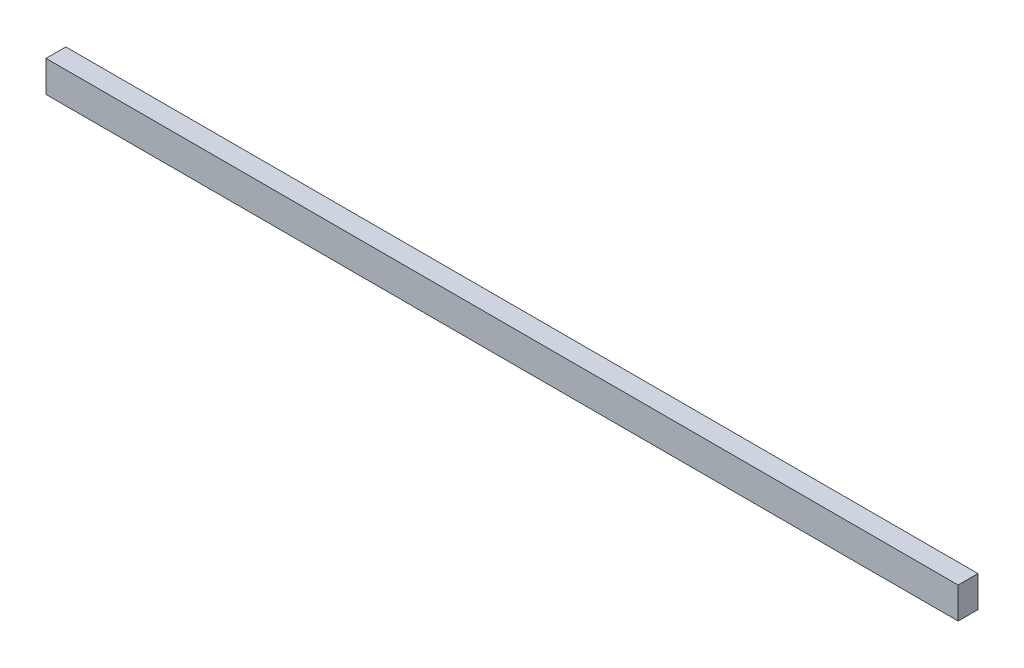
ISO-10303-21;
HEADER;
FILE_DESCRIPTION(('STEP AP214'),'2;1');
FILE_NAME('part.step','',(''),(''),'','','');
FILE_SCHEMA(('AUTOMOTIVE_DESIGN { 1 0 10303 214 1 1 1 1 }'));
ENDSEC;
DATA;
#1=APPLICATION_CONTEXT('core data for automotive mechanical design processes');
#2=APPLICATION_PROTOCOL_DEFINITION('international standard','automotive_design',2000,#1);
#3=PRODUCT_CONTEXT('',#1,'mechanical');
#4=PRODUCT('Part','Part','',(#3));
#5=PRODUCT_RELATED_PRODUCT_CATEGORY('part','',(#4));
#6=PRODUCT_DEFINITION_FORMATION('','',#4);
#7=PRODUCT_DEFINITION_CONTEXT('part definition',#1,'design');
#8=PRODUCT_DEFINITION('design','',#6,#7);
#9=PRODUCT_DEFINITION_SHAPE('','',#8);
#10=(LENGTH_UNIT() NAMED_UNIT(*) SI_UNIT(.MILLI.,.METRE.));
#11=(NAMED_UNIT(*) PLANE_ANGLE_UNIT() SI_UNIT($,.RADIAN.));
#12=(NAMED_UNIT(*) SI_UNIT($,.STERADIAN.) SOLID_ANGLE_UNIT());
#13=UNCERTAINTY_MEASURE_WITH_UNIT(LENGTH_MEASURE(1.E-05),#10,'distance_accuracy_value','');
#14=(GEOMETRIC_REPRESENTATION_CONTEXT(3) GLOBAL_UNCERTAINTY_ASSIGNED_CONTEXT((#13)) GLOBAL_UNIT_ASSIGNED_CONTEXT((#10,
#11,#12)) REPRESENTATION_CONTEXT('',''));
#15=CARTESIAN_POINT('',(0.,0.,0.));
#16=DIRECTION('',(0.,0.,1.));
#17=DIRECTION('',(1.,0.,0.));
#18=AXIS2_PLACEMENT_3D('',#15,#16,#17);
#19=CARTESIAN_POINT('',(146.05,-5.,6.35));
#20=DIRECTION('',(-1.,0.,0.));
#21=DIRECTION('',(0.,0.,1.));
#22=AXIS2_PLACEMENT_3D('',#19,#20,#21);
#23=PLANE('',#22);
#24=DIRECTION('',(0.,1.,0.));
#25=VECTOR('',#24,1.);
#26=CARTESIAN_POINT('',(146.05,-5.,0.));
#27=LINE('',#26,#25);
#28=CARTESIAN_POINT('',(146.05,-5.,0.));
#29=VERTEX_POINT('',#28);
#30=CARTESIAN_POINT('',(146.05,5.,0.));
#31=VERTEX_POINT('',#30);
#32=EDGE_CURVE('E99',#29,#31,#27,.T.);
#33=ORIENTED_EDGE('',*,*,#32,.T.);
#34=DIRECTION('',(0.,0.,-1.));
#35=VECTOR('',#34,1.);
#36=CARTESIAN_POINT('',(146.05,5.,6.35));
#37=LINE('',#36,#35);
#38=CARTESIAN_POINT('',(146.05,5.,6.35));
#39=VERTEX_POINT('',#38);
#40=EDGE_CURVE('E11',#39,#31,#37,.T.);
#41=ORIENTED_EDGE('',*,*,#40,.F.);
#42=DIRECTION('',(0.,1.,0.));
#43=VECTOR('',#42,1.);
#44=CARTESIAN_POINT('',(146.05,-5.,6.35));
#45=LINE('',#44,#43);
#46=CARTESIAN_POINT('',(146.05,-5.,6.35));
#47=VERTEX_POINT('',#46);
#48=EDGE_CURVE('E87',#47,#39,#45,.T.);
#49=ORIENTED_EDGE('',*,*,#48,.F.);
#50=DIRECTION('',(0.,0.,-1.));
#51=VECTOR('',#50,1.);
#52=CARTESIAN_POINT('',(146.05,-5.,6.35));
#53=LINE('',#52,#51);
#54=EDGE_CURVE('E95',#47,#29,#53,.T.);
#55=ORIENTED_EDGE('',*,*,#54,.T.);
#56=EDGE_LOOP('',(#33,#41,#49,#55));
#57=FACE_BOUND('',#56,.T.);
#58=ADVANCED_FACE('F36',(#57),#23,.F.);
#59=CARTESIAN_POINT('',(-146.05,5.,6.35));
#60=DIRECTION('',(0.,-1.,0.));
#61=DIRECTION('',(0.,0.,-1.));
#62=AXIS2_PLACEMENT_3D('',#59,#60,#61);
#63=PLANE('',#62);
#64=DIRECTION('',(-1.,0.,0.));
#65=VECTOR('',#64,1.);
#66=CARTESIAN_POINT('',(-146.05,5.,0.));
#67=LINE('',#66,#65);
#68=CARTESIAN_POINT('',(-146.05,5.,0.));
#69=VERTEX_POINT('',#68);
#70=EDGE_CURVE('E91',#31,#69,#67,.T.);
#71=ORIENTED_EDGE('',*,*,#70,.T.);
#72=DIRECTION('',(0.,0.,-1.));
#73=VECTOR('',#72,1.);
#74=CARTESIAN_POINT('',(-146.05,5.,6.35));
#75=LINE('',#74,#73);
#76=CARTESIAN_POINT('',(-146.05,5.,6.35));
#77=VERTEX_POINT('',#76);
#78=EDGE_CURVE('E44',#77,#69,#75,.T.);
#79=ORIENTED_EDGE('',*,*,#78,.F.);
#80=DIRECTION('',(-1.,0.,0.));
#81=VECTOR('',#80,1.);
#82=CARTESIAN_POINT('',(-146.05,5.,6.35));
#83=LINE('',#82,#81);
#84=EDGE_CURVE('E82',#39,#77,#83,.T.);
#85=ORIENTED_EDGE('',*,*,#84,.F.);
#86=ORIENTED_EDGE('',*,*,#40,.T.);
#87=EDGE_LOOP('',(#71,#79,#85,#86));
#88=FACE_BOUND('',#87,.T.);
#89=ADVANCED_FACE('F90',(#88),#63,.F.);
#90=CARTESIAN_POINT('',(-146.05,-5.,6.35));
#91=DIRECTION('',(1.,0.,0.));
#92=DIRECTION('',(0.,0.,-1.));
#93=AXIS2_PLACEMENT_3D('',#90,#91,#92);
#94=PLANE('',#93);
#95=DIRECTION('',(0.,-1.,0.));
#96=VECTOR('',#95,1.);
#97=CARTESIAN_POINT('',(-146.05,-5.,0.));
#98=LINE('',#97,#96);
#99=CARTESIAN_POINT('',(-146.05,-5.,0.));
#100=VERTEX_POINT('',#99);
#101=EDGE_CURVE('E69',#69,#100,#98,.T.);
#102=ORIENTED_EDGE('',*,*,#101,.T.);
#103=DIRECTION('',(0.,0.,-1.));
#104=VECTOR('',#103,1.);
#105=CARTESIAN_POINT('',(-146.05,-5.,6.35));
#106=LINE('',#105,#104);
#107=CARTESIAN_POINT('',(-146.05,-5.,6.35));
#108=VERTEX_POINT('',#107);
#109=EDGE_CURVE('E92',#108,#100,#106,.T.);
#110=ORIENTED_EDGE('',*,*,#109,.F.);
#111=DIRECTION('',(0.,-1.,0.));
#112=VECTOR('',#111,1.);
#113=CARTESIAN_POINT('',(-146.05,-5.,6.35));
#114=LINE('',#113,#112);
#115=EDGE_CURVE('E85',#77,#108,#114,.T.);
#116=ORIENTED_EDGE('',*,*,#115,.F.);
#117=ORIENTED_EDGE('',*,*,#78,.T.);
#118=EDGE_LOOP('',(#102,#110,#116,#117));
#119=FACE_BOUND('',#118,.T.);
#120=ADVANCED_FACE('F93',(#119),#94,.F.);
#121=CARTESIAN_POINT('',(-146.05,-5.,6.35));
#122=DIRECTION('',(0.,1.,0.));
#123=DIRECTION('',(0.,0.,1.));
#124=AXIS2_PLACEMENT_3D('',#121,#122,#123);
#125=PLANE('',#124);
#126=DIRECTION('',(1.,0.,0.));
#127=VECTOR('',#126,1.);
#128=CARTESIAN_POINT('',(-146.05,-5.,0.));
#129=LINE('',#128,#127);
#130=EDGE_CURVE('E75',#100,#29,#129,.T.);
#131=ORIENTED_EDGE('',*,*,#130,.T.);
#132=ORIENTED_EDGE('',*,*,#54,.F.);
#133=DIRECTION('',(1.,0.,0.));
#134=VECTOR('',#133,1.);
#135=CARTESIAN_POINT('',(-146.05,-5.,6.35));
#136=LINE('',#135,#134);
#137=EDGE_CURVE('E52',#108,#47,#136,.T.);
#138=ORIENTED_EDGE('',*,*,#137,.F.);
#139=ORIENTED_EDGE('',*,*,#109,.T.);
#140=EDGE_LOOP('',(#131,#132,#138,#139));
#141=FACE_BOUND('',#140,.T.);
#142=ADVANCED_FACE('F106',(#141),#125,.F.);
#143=CARTESIAN_POINT('',(0.,0.,6.35));
#144=DIRECTION('',(0.,0.,-1.));
#145=DIRECTION('',(-1.,0.,0.));
#146=AXIS2_PLACEMENT_3D('',#143,#144,#145);
#147=PLANE('',#146);
#148=ORIENTED_EDGE('',*,*,#48,.T.);
#149=ORIENTED_EDGE('',*,*,#84,.T.);
#150=ORIENTED_EDGE('',*,*,#115,.T.);
#151=ORIENTED_EDGE('',*,*,#137,.T.);
#152=EDGE_LOOP('',(#148,#149,#150,#151));
#153=FACE_BOUND('',#152,.T.);
#154=ADVANCED_FACE('F83',(#153),#147,.F.);
#155=CARTESIAN_POINT('',(0.,0.,0.));
#156=DIRECTION('',(0.,0.,-1.));
#157=DIRECTION('',(-1.,0.,0.));
#158=AXIS2_PLACEMENT_3D('',#155,#156,#157);
#159=PLANE('',#158);
#160=ORIENTED_EDGE('',*,*,#32,.F.);
#161=ORIENTED_EDGE('',*,*,#130,.F.);
#162=ORIENTED_EDGE('',*,*,#101,.F.);
#163=ORIENTED_EDGE('',*,*,#70,.F.);
#164=EDGE_LOOP('',(#160,#161,#162,#163));
#165=FACE_BOUND('',#164,.T.);
#166=ADVANCED_FACE('F109',(#165),#159,.T.);
#167=CLOSED_SHELL('',(#58,#89,#120,#142,#154,#166));
#168=MANIFOLD_SOLID_BREP('B2',#167);
#169=ADVANCED_BREP_SHAPE_REPRESENTATION('',(#18,#168),#14);
#170=SHAPE_DEFINITION_REPRESENTATION(#9,#169);
ENDSEC;
END-ISO-10303-21;
